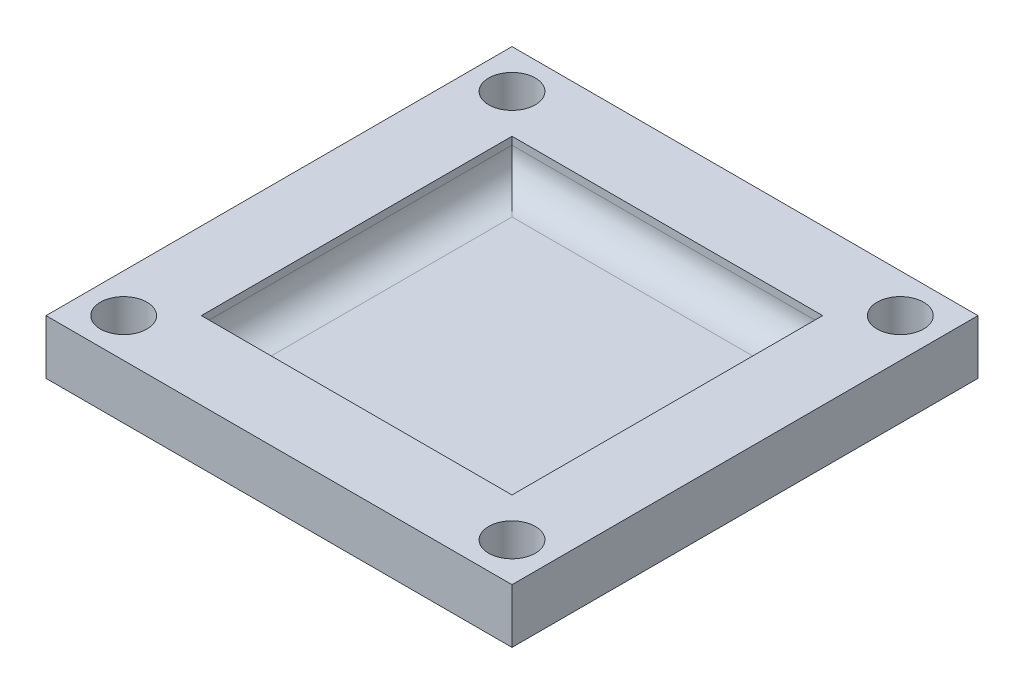
ISO-10303-21;
HEADER;
FILE_DESCRIPTION(('STEP AP214'),'2;1');
FILE_NAME('part.step','',(''),(''),'','','');
FILE_SCHEMA(('AUTOMOTIVE_DESIGN { 1 0 10303 214 1 1 1 1 }'));
ENDSEC;
DATA;
#1=APPLICATION_CONTEXT('core data for automotive mechanical design processes');
#2=APPLICATION_PROTOCOL_DEFINITION('international standard','automotive_design',2000,#1);
#3=PRODUCT_CONTEXT('',#1,'mechanical');
#4=PRODUCT('Part','Part','',(#3));
#5=PRODUCT_RELATED_PRODUCT_CATEGORY('part','',(#4));
#6=PRODUCT_DEFINITION_FORMATION('','',#4);
#7=PRODUCT_DEFINITION_CONTEXT('part definition',#1,'design');
#8=PRODUCT_DEFINITION('design','',#6,#7);
#9=PRODUCT_DEFINITION_SHAPE('','',#8);
#10=(LENGTH_UNIT() NAMED_UNIT(*) SI_UNIT(.MILLI.,.METRE.));
#11=(NAMED_UNIT(*) PLANE_ANGLE_UNIT() SI_UNIT($,.RADIAN.));
#12=(NAMED_UNIT(*) SI_UNIT($,.STERADIAN.) SOLID_ANGLE_UNIT());
#13=UNCERTAINTY_MEASURE_WITH_UNIT(LENGTH_MEASURE(1.E-05),#10,'distance_accuracy_value','');
#14=(GEOMETRIC_REPRESENTATION_CONTEXT(3) GLOBAL_UNCERTAINTY_ASSIGNED_CONTEXT((#13)) GLOBAL_UNIT_ASSIGNED_CONTEXT((#10,
#11,#12)) REPRESENTATION_CONTEXT('',''));
#15=CARTESIAN_POINT('',(0.,0.,0.));
#16=DIRECTION('',(0.,0.,1.));
#17=DIRECTION('',(1.,0.,0.));
#18=AXIS2_PLACEMENT_3D('',#15,#16,#17);
#19=CARTESIAN_POINT('',(-9.99999999999091,3.5,291583.5));
#20=DIRECTION('',(-1.,0.,0.));
#21=DIRECTION('',(0.,0.,1.));
#22=AXIS2_PLACEMENT_3D('',#19,#20,#21);
#23=PLANE('',#22);
#24=DIRECTION('',(0.,-1.,0.));
#25=VECTOR('',#24,1.);
#26=CARTESIAN_POINT('',(-9.99999999999091,3.5,9.99999999999091));
#27=LINE('',#26,#25);
#28=CARTESIAN_POINT('',(-9.99999999999091,3.5,9.99999999999091));
#29=VERTEX_POINT('',#28);
#30=CARTESIAN_POINT('',(-9.99999999999091,3.,9.99999999999091));
#31=VERTEX_POINT('',#30);
#32=EDGE_CURVE('E148',#29,#31,#27,.T.);
#33=ORIENTED_EDGE('',*,*,#32,.T.);
#34=DIRECTION('',(0.,0.,-1.));
#35=VECTOR('',#34,1.);
#36=CARTESIAN_POINT('',(-9.99999999999091,3.,-9.99999999999091));
#37=LINE('',#36,#35);
#38=CARTESIAN_POINT('',(-9.99999999999091,3.,-9.99999999999091));
#39=VERTEX_POINT('',#38);
#40=EDGE_CURVE('E11',#31,#39,#37,.T.);
#41=ORIENTED_EDGE('',*,*,#40,.T.);
#42=DIRECTION('',(0.,-1.,0.));
#43=VECTOR('',#42,1.);
#44=CARTESIAN_POINT('',(-9.99999999999091,3.5,-9.99999999999091));
#45=LINE('',#44,#43);
#46=CARTESIAN_POINT('',(-9.99999999999091,3.5,-9.99999999999091));
#47=VERTEX_POINT('',#46);
#48=EDGE_CURVE('E115',#47,#39,#45,.T.);
#49=ORIENTED_EDGE('',*,*,#48,.F.);
#50=DIRECTION('',(0.,0.,-1.));
#51=VECTOR('',#50,1.);
#52=CARTESIAN_POINT('',(-9.99999999999091,3.5,291583.5));
#53=LINE('',#52,#51);
#54=EDGE_CURVE('E118',#29,#47,#53,.T.);
#55=ORIENTED_EDGE('',*,*,#54,.F.);
#56=EDGE_LOOP('',(#33,#41,#49,#55));
#57=FACE_BOUND('',#56,.T.);
#58=ADVANCED_FACE('F39',(#57),#23,.F.);
#59=CARTESIAN_POINT('',(-400000.,3.5,9.99999999999091));
#60=DIRECTION('',(0.,0.,1.));
#61=DIRECTION('',(1.,0.,0.));
#62=AXIS2_PLACEMENT_3D('',#59,#60,#61);
#63=PLANE('',#62);
#64=DIRECTION('',(0.,-1.,0.));
#65=VECTOR('',#64,1.);
#66=CARTESIAN_POINT('',(9.99999999999091,3.5,9.99999999999091));
#67=LINE('',#66,#65);
#68=CARTESIAN_POINT('',(9.99999999999091,3.5,9.99999999999091));
#69=VERTEX_POINT('',#68);
#70=CARTESIAN_POINT('',(9.99999999999091,3.,9.99999999999091));
#71=VERTEX_POINT('',#70);
#72=EDGE_CURVE('E151',#69,#71,#67,.T.);
#73=ORIENTED_EDGE('',*,*,#72,.T.);
#74=DIRECTION('',(1.,0.,0.));
#75=VECTOR('',#74,1.);
#76=CARTESIAN_POINT('',(-9.99999999999091,3.,9.99999999999091));
#77=LINE('',#76,#75);
#78=EDGE_CURVE('E62',#71,#31,#77,.F.);
#79=ORIENTED_EDGE('',*,*,#78,.T.);
#80=ORIENTED_EDGE('',*,*,#32,.F.);
#81=DIRECTION('',(-1.,0.,0.));
#82=VECTOR('',#81,1.);
#83=CARTESIAN_POINT('',(-400000.,3.5,9.99999999999091));
#84=LINE('',#83,#82);
#85=EDGE_CURVE('E123',#69,#29,#84,.T.);
#86=ORIENTED_EDGE('',*,*,#85,.F.);
#87=EDGE_LOOP('',(#73,#79,#80,#86));
#88=FACE_BOUND('',#87,.T.);
#89=ADVANCED_FACE('F258',(#88),#63,.F.);
#90=CARTESIAN_POINT('',(9.99999999999091,3.5,291583.5));
#91=DIRECTION('',(1.,0.,0.));
#92=DIRECTION('',(0.,0.,-1.));
#93=AXIS2_PLACEMENT_3D('',#90,#91,#92);
#94=PLANE('',#93);
#95=DIRECTION('',(0.,-1.,0.));
#96=VECTOR('',#95,1.);
#97=CARTESIAN_POINT('',(9.99999999999091,3.5,-9.99999999999091));
#98=LINE('',#97,#96);
#99=CARTESIAN_POINT('',(9.99999999999091,3.5,-9.99999999999091));
#100=VERTEX_POINT('',#99);
#101=CARTESIAN_POINT('',(9.99999999999091,3.,-9.99999999999091));
#102=VERTEX_POINT('',#101);
#103=EDGE_CURVE('E122',#100,#102,#98,.T.);
#104=ORIENTED_EDGE('',*,*,#103,.T.);
#105=DIRECTION('',(0.,0.,-1.));
#106=VECTOR('',#105,1.);
#107=CARTESIAN_POINT('',(9.99999999999091,3.,9.99999999999091));
#108=LINE('',#107,#106);
#109=EDGE_CURVE('E194',#102,#71,#108,.F.);
#110=ORIENTED_EDGE('',*,*,#109,.T.);
#111=ORIENTED_EDGE('',*,*,#72,.F.);
#112=DIRECTION('',(0.,0.,1.));
#113=VECTOR('',#112,1.);
#114=CARTESIAN_POINT('',(9.99999999999091,3.5,291583.5));
#115=LINE('',#114,#113);
#116=EDGE_CURVE('E132',#100,#69,#115,.T.);
#117=ORIENTED_EDGE('',*,*,#116,.F.);
#118=EDGE_LOOP('',(#104,#110,#111,#117));
#119=FACE_BOUND('',#118,.T.);
#120=ADVANCED_FACE('F262',(#119),#94,.F.);
#121=CARTESIAN_POINT('',(-400000.,3.5,-9.99999999999091));
#122=DIRECTION('',(0.,0.,-1.));
#123=DIRECTION('',(-1.,0.,0.));
#124=AXIS2_PLACEMENT_3D('',#121,#122,#123);
#125=PLANE('',#124);
#126=ORIENTED_EDGE('',*,*,#48,.T.);
#127=DIRECTION('',(1.,0.,0.));
#128=VECTOR('',#127,1.);
#129=CARTESIAN_POINT('',(9.99999999999091,3.,-9.99999999999091));
#130=LINE('',#129,#128);
#131=EDGE_CURVE('E48',#39,#102,#130,.T.);
#132=ORIENTED_EDGE('',*,*,#131,.T.);
#133=ORIENTED_EDGE('',*,*,#103,.F.);
#134=DIRECTION('',(1.,0.,0.));
#135=VECTOR('',#134,1.);
#136=CARTESIAN_POINT('',(-400000.,3.5,-9.99999999999091));
#137=LINE('',#136,#135);
#138=EDGE_CURVE('E127',#47,#100,#137,.T.);
#139=ORIENTED_EDGE('',*,*,#138,.F.);
#140=EDGE_LOOP('',(#126,#132,#133,#139));
#141=FACE_BOUND('',#140,.T.);
#142=ADVANCED_FACE('F128',(#141),#125,.F.);
#143=CARTESIAN_POINT('',(-14.9999999999864,3.5,291583.5));
#144=DIRECTION('',(-1.,0.,0.));
#145=DIRECTION('',(0.,0.,1.));
#146=AXIS2_PLACEMENT_3D('',#143,#144,#145);
#147=PLANE('',#146);
#148=DIRECTION('',(0.,0.,-1.));
#149=VECTOR('',#148,1.);
#150=CARTESIAN_POINT('',(-14.9999999999864,0.,291583.5));
#151=LINE('',#150,#149);
#152=CARTESIAN_POINT('',(-14.9999999999864,0.,14.9999999999864));
#153=VERTEX_POINT('',#152);
#154=CARTESIAN_POINT('',(-14.9999999999864,0.,-14.9999999999864));
#155=VERTEX_POINT('',#154);
#156=EDGE_CURVE('E150',#153,#155,#151,.T.);
#157=ORIENTED_EDGE('',*,*,#156,.F.);
#158=DIRECTION('',(0.,-1.,0.));
#159=VECTOR('',#158,1.);
#160=CARTESIAN_POINT('',(-14.9999999999864,3.5,14.9999999999864));
#161=LINE('',#160,#159);
#162=CARTESIAN_POINT('',(-14.9999999999864,3.5,14.9999999999864));
#163=VERTEX_POINT('',#162);
#164=EDGE_CURVE('E178',#163,#153,#161,.T.);
#165=ORIENTED_EDGE('',*,*,#164,.F.);
#166=DIRECTION('',(0.,0.,-1.));
#167=VECTOR('',#166,1.);
#168=CARTESIAN_POINT('',(-14.9999999999864,3.5,291583.5));
#169=LINE('',#168,#167);
#170=CARTESIAN_POINT('',(-14.9999999999864,3.5,-14.9999999999864));
#171=VERTEX_POINT('',#170);
#172=EDGE_CURVE('E154',#163,#171,#169,.T.);
#173=ORIENTED_EDGE('',*,*,#172,.T.);
#174=DIRECTION('',(0.,-1.,0.));
#175=VECTOR('',#174,1.);
#176=CARTESIAN_POINT('',(-14.9999999999864,3.5,-14.9999999999864));
#177=LINE('',#176,#175);
#178=EDGE_CURVE('E167',#171,#155,#177,.T.);
#179=ORIENTED_EDGE('',*,*,#178,.T.);
#180=EDGE_LOOP('',(#157,#165,#173,#179));
#181=FACE_BOUND('',#180,.T.);
#182=ADVANCED_FACE('F234',(#181),#147,.T.);
#183=CARTESIAN_POINT('',(-400000.,3.5,14.9999999999864));
#184=DIRECTION('',(0.,0.,1.));
#185=DIRECTION('',(1.,0.,0.));
#186=AXIS2_PLACEMENT_3D('',#183,#184,#185);
#187=PLANE('',#186);
#188=DIRECTION('',(-1.,0.,0.));
#189=VECTOR('',#188,1.);
#190=CARTESIAN_POINT('',(-400000.,0.,14.9999999999864));
#191=LINE('',#190,#189);
#192=CARTESIAN_POINT('',(14.9999999999864,0.,14.9999999999864));
#193=VERTEX_POINT('',#192);
#194=EDGE_CURVE('E158',#193,#153,#191,.T.);
#195=ORIENTED_EDGE('',*,*,#194,.F.);
#196=DIRECTION('',(0.,-1.,0.));
#197=VECTOR('',#196,1.);
#198=CARTESIAN_POINT('',(14.9999999999864,3.5,14.9999999999864));
#199=LINE('',#198,#197);
#200=CARTESIAN_POINT('',(14.9999999999864,3.5,14.9999999999864));
#201=VERTEX_POINT('',#200);
#202=EDGE_CURVE('E181',#201,#193,#199,.T.);
#203=ORIENTED_EDGE('',*,*,#202,.F.);
#204=DIRECTION('',(-1.,0.,0.));
#205=VECTOR('',#204,1.);
#206=CARTESIAN_POINT('',(-400000.,3.5,14.9999999999864));
#207=LINE('',#206,#205);
#208=EDGE_CURVE('E164',#201,#163,#207,.T.);
#209=ORIENTED_EDGE('',*,*,#208,.T.);
#210=ORIENTED_EDGE('',*,*,#164,.T.);
#211=EDGE_LOOP('',(#195,#203,#209,#210));
#212=FACE_BOUND('',#211,.T.);
#213=ADVANCED_FACE('F244',(#212),#187,.T.);
#214=CARTESIAN_POINT('',(14.9999999999864,3.5,291583.5));
#215=DIRECTION('',(1.,0.,0.));
#216=DIRECTION('',(0.,0.,-1.));
#217=AXIS2_PLACEMENT_3D('',#214,#215,#216);
#218=PLANE('',#217);
#219=DIRECTION('',(0.,0.,1.));
#220=VECTOR('',#219,1.);
#221=CARTESIAN_POINT('',(14.9999999999864,0.,291583.5));
#222=LINE('',#221,#220);
#223=CARTESIAN_POINT('',(14.9999999999864,0.,-14.9999999999864));
#224=VERTEX_POINT('',#223);
#225=EDGE_CURVE('E173',#224,#193,#222,.T.);
#226=ORIENTED_EDGE('',*,*,#225,.F.);
#227=DIRECTION('',(0.,-1.,0.));
#228=VECTOR('',#227,1.);
#229=CARTESIAN_POINT('',(14.9999999999864,3.5,-14.9999999999864));
#230=LINE('',#229,#228);
#231=CARTESIAN_POINT('',(14.9999999999864,3.5,-14.9999999999864));
#232=VERTEX_POINT('',#231);
#233=EDGE_CURVE('E183',#232,#224,#230,.T.);
#234=ORIENTED_EDGE('',*,*,#233,.F.);
#235=DIRECTION('',(0.,0.,1.));
#236=VECTOR('',#235,1.);
#237=CARTESIAN_POINT('',(14.9999999999864,3.5,291583.5));
#238=LINE('',#237,#236);
#239=EDGE_CURVE('E161',#232,#201,#238,.T.);
#240=ORIENTED_EDGE('',*,*,#239,.T.);
#241=ORIENTED_EDGE('',*,*,#202,.T.);
#242=EDGE_LOOP('',(#226,#234,#240,#241));
#243=FACE_BOUND('',#242,.T.);
#244=ADVANCED_FACE('F242',(#243),#218,.T.);
#245=CARTESIAN_POINT('',(-400000.,3.5,-14.9999999999864));
#246=DIRECTION('',(0.,0.,-1.));
#247=DIRECTION('',(-1.,0.,0.));
#248=AXIS2_PLACEMENT_3D('',#245,#246,#247);
#249=PLANE('',#248);
#250=DIRECTION('',(1.,0.,0.));
#251=VECTOR('',#250,1.);
#252=CARTESIAN_POINT('',(-400000.,0.,-14.9999999999864));
#253=LINE('',#252,#251);
#254=EDGE_CURVE('E170',#155,#224,#253,.T.);
#255=ORIENTED_EDGE('',*,*,#254,.F.);
#256=ORIENTED_EDGE('',*,*,#178,.F.);
#257=DIRECTION('',(1.,0.,0.));
#258=VECTOR('',#257,1.);
#259=CARTESIAN_POINT('',(-400000.,3.5,-14.9999999999864));
#260=LINE('',#259,#258);
#261=EDGE_CURVE('E157',#171,#232,#260,.T.);
#262=ORIENTED_EDGE('',*,*,#261,.T.);
#263=ORIENTED_EDGE('',*,*,#233,.T.);
#264=EDGE_LOOP('',(#255,#256,#262,#263));
#265=FACE_BOUND('',#264,.T.);
#266=ADVANCED_FACE('F238',(#265),#249,.T.);
#267=CARTESIAN_POINT('',(0.,3.5,0.));
#268=DIRECTION('',(0.,-1.,0.));
#269=DIRECTION('',(0.,0.,-1.));
#270=AXIS2_PLACEMENT_3D('',#267,#268,#269);
#271=PLANE('',#270);
#272=CARTESIAN_POINT('',(-12.4999999999932,3.5,12.4999999999932));
#273=DIRECTION('',(0.,1.,0.));
#274=DIRECTION('',(0.,0.,1.));
#275=AXIS2_PLACEMENT_3D('',#272,#273,#274);
#276=CIRCLE('',#275,1.5);
#277=CARTESIAN_POINT('',(-12.4999999999932,3.5,13.9999999999932));
#278=VERTEX_POINT('',#277);
#279=EDGE_CURVE('E297',#278,#278,#276,.T.);
#280=ORIENTED_EDGE('',*,*,#279,.F.);
#281=EDGE_LOOP('',(#280));
#282=FACE_BOUND('',#281,.T.);
#283=CARTESIAN_POINT('',(12.4999999999955,3.5,12.4999999999955));
#284=DIRECTION('',(0.,1.,0.));
#285=DIRECTION('',(0.,0.,1.));
#286=AXIS2_PLACEMENT_3D('',#283,#284,#285);
#287=CIRCLE('',#286,1.5);
#288=CARTESIAN_POINT('',(12.4999999999955,3.5,13.9999999999955));
#289=VERTEX_POINT('',#288);
#290=EDGE_CURVE('E293',#289,#289,#287,.T.);
#291=ORIENTED_EDGE('',*,*,#290,.F.);
#292=EDGE_LOOP('',(#291));
#293=FACE_BOUND('',#292,.T.);
#294=CARTESIAN_POINT('',(12.4999999999932,3.5,-12.4999999999932));
#295=DIRECTION('',(0.,1.,0.));
#296=DIRECTION('',(0.,0.,1.));
#297=AXIS2_PLACEMENT_3D('',#294,#295,#296);
#298=CIRCLE('',#297,1.5);
#299=CARTESIAN_POINT('',(12.4999999999932,3.5,-10.9999999999932));
#300=VERTEX_POINT('',#299);
#301=EDGE_CURVE('E291',#300,#300,#298,.T.);
#302=ORIENTED_EDGE('',*,*,#301,.F.);
#303=EDGE_LOOP('',(#302));
#304=FACE_BOUND('',#303,.T.);
#305=CARTESIAN_POINT('',(-12.4999999999886,3.5,-12.4999999999886));
#306=DIRECTION('',(0.,1.,0.));
#307=DIRECTION('',(0.,0.,1.));
#308=AXIS2_PLACEMENT_3D('',#305,#306,#307);
#309=CIRCLE('',#308,1.5);
#310=CARTESIAN_POINT('',(-12.4999999999886,3.5,-10.9999999999886));
#311=VERTEX_POINT('',#310);
#312=EDGE_CURVE('E143',#311,#311,#309,.T.);
#313=ORIENTED_EDGE('',*,*,#312,.F.);
#314=EDGE_LOOP('',(#313));
#315=FACE_BOUND('',#314,.T.);
#316=ORIENTED_EDGE('',*,*,#85,.T.);
#317=ORIENTED_EDGE('',*,*,#54,.T.);
#318=ORIENTED_EDGE('',*,*,#138,.T.);
#319=ORIENTED_EDGE('',*,*,#116,.T.);
#320=EDGE_LOOP('',(#316,#317,#318,#319));
#321=FACE_BOUND('',#320,.T.);
#322=ORIENTED_EDGE('',*,*,#172,.F.);
#323=ORIENTED_EDGE('',*,*,#208,.F.);
#324=ORIENTED_EDGE('',*,*,#239,.F.);
#325=ORIENTED_EDGE('',*,*,#261,.F.);
#326=EDGE_LOOP('',(#322,#323,#324,#325));
#327=FACE_BOUND('',#326,.T.);
#328=ADVANCED_FACE('F134',(#282,#293,#304,#315,#321,#327),#271,.F.);
#329=CARTESIAN_POINT('',(0.,0.,0.));
#330=DIRECTION('',(0.,-1.,0.));
#331=DIRECTION('',(0.,0.,-1.));
#332=AXIS2_PLACEMENT_3D('',#329,#330,#331);
#333=PLANE('',#332);
#334=CARTESIAN_POINT('',(-12.4999999999932,0.,12.4999999999932));
#335=DIRECTION('',(0.,-1.,0.));
#336=DIRECTION('',(0.,0.,-1.));
#337=AXIS2_PLACEMENT_3D('',#334,#335,#336);
#338=CIRCLE('',#337,1.5);
#339=CARTESIAN_POINT('',(-12.4999999999932,0.,10.9999999999932));
#340=VERTEX_POINT('',#339);
#341=EDGE_CURVE('E43',#340,#340,#338,.T.);
#342=ORIENTED_EDGE('',*,*,#341,.F.);
#343=EDGE_LOOP('',(#342));
#344=FACE_BOUND('',#343,.T.);
#345=CARTESIAN_POINT('',(12.4999999999955,0.,12.4999999999955));
#346=DIRECTION('',(0.,-1.,0.));
#347=DIRECTION('',(0.,0.,-1.));
#348=AXIS2_PLACEMENT_3D('',#345,#346,#347);
#349=CIRCLE('',#348,1.5);
#350=CARTESIAN_POINT('',(12.4999999999955,0.,10.9999999999955));
#351=VERTEX_POINT('',#350);
#352=EDGE_CURVE('E210',#351,#351,#349,.T.);
#353=ORIENTED_EDGE('',*,*,#352,.F.);
#354=EDGE_LOOP('',(#353));
#355=FACE_BOUND('',#354,.T.);
#356=CARTESIAN_POINT('',(12.4999999999932,0.,-12.4999999999932));
#357=DIRECTION('',(0.,-1.,0.));
#358=DIRECTION('',(0.,0.,-1.));
#359=AXIS2_PLACEMENT_3D('',#356,#357,#358);
#360=CIRCLE('',#359,1.5);
#361=CARTESIAN_POINT('',(12.4999999999932,0.,-13.9999999999932));
#362=VERTEX_POINT('',#361);
#363=EDGE_CURVE('E208',#362,#362,#360,.T.);
#364=ORIENTED_EDGE('',*,*,#363,.F.);
#365=EDGE_LOOP('',(#364));
#366=FACE_BOUND('',#365,.T.);
#367=CARTESIAN_POINT('',(-12.4999999999886,0.,-12.4999999999886));
#368=DIRECTION('',(0.,-1.,0.));
#369=DIRECTION('',(0.,0.,-1.));
#370=AXIS2_PLACEMENT_3D('',#367,#368,#369);
#371=CIRCLE('',#370,1.5);
#372=CARTESIAN_POINT('',(-12.4999999999886,0.,-13.9999999999886));
#373=VERTEX_POINT('',#372);
#374=EDGE_CURVE('E205',#373,#373,#371,.T.);
#375=ORIENTED_EDGE('',*,*,#374,.F.);
#376=EDGE_LOOP('',(#375));
#377=FACE_BOUND('',#376,.T.);
#378=ORIENTED_EDGE('',*,*,#156,.T.);
#379=ORIENTED_EDGE('',*,*,#254,.T.);
#380=ORIENTED_EDGE('',*,*,#225,.T.);
#381=ORIENTED_EDGE('',*,*,#194,.T.);
#382=EDGE_LOOP('',(#378,#379,#380,#381));
#383=FACE_BOUND('',#382,.T.);
#384=ADVANCED_FACE('F220',(#344,#355,#366,#377,#383),#333,.T.);
#385=CARTESIAN_POINT('',(0.,1.,0.));
#386=DIRECTION('',(0.,-1.,0.));
#387=DIRECTION('',(0.,0.,-1.));
#388=AXIS2_PLACEMENT_3D('',#385,#386,#387);
#389=PLANE('',#388);
#390=DIRECTION('',(1.,0.,0.));
#391=VECTOR('',#390,1.);
#392=CARTESIAN_POINT('',(9.99999999999091,1.,7.99999999999091));
#393=LINE('',#392,#391);
#394=CARTESIAN_POINT('',(-7.99999999999091,1.,7.99999999999091));
#395=VERTEX_POINT('',#394);
#396=CARTESIAN_POINT('',(7.99999999999091,1.,7.99999999999091));
#397=VERTEX_POINT('',#396);
#398=EDGE_CURVE('E189',#395,#397,#393,.T.);
#399=ORIENTED_EDGE('',*,*,#398,.T.);
#400=DIRECTION('',(0.,0.,-1.));
#401=VECTOR('',#400,1.);
#402=CARTESIAN_POINT('',(7.99999999999091,1.,-9.99999999999091));
#403=LINE('',#402,#401);
#404=CARTESIAN_POINT('',(7.99999999999091,1.,-7.99999999999091));
#405=VERTEX_POINT('',#404);
#406=EDGE_CURVE('E191',#397,#405,#403,.T.);
#407=ORIENTED_EDGE('',*,*,#406,.T.);
#408=DIRECTION('',(1.,0.,0.));
#409=VECTOR('',#408,1.);
#410=CARTESIAN_POINT('',(-9.99999999999091,1.,-7.99999999999091));
#411=LINE('',#410,#409);
#412=CARTESIAN_POINT('',(-7.99999999999091,1.,-7.99999999999091));
#413=VERTEX_POINT('',#412);
#414=EDGE_CURVE('E187',#405,#413,#411,.F.);
#415=ORIENTED_EDGE('',*,*,#414,.T.);
#416=DIRECTION('',(0.,0.,-1.));
#417=VECTOR('',#416,1.);
#418=CARTESIAN_POINT('',(-7.99999999999091,1.,9.99999999999091));
#419=LINE('',#418,#417);
#420=EDGE_CURVE('E180',#413,#395,#419,.F.);
#421=ORIENTED_EDGE('',*,*,#420,.T.);
#422=EDGE_LOOP('',(#399,#407,#415,#421));
#423=FACE_BOUND('',#422,.T.);
#424=ADVANCED_FACE('F223',(#423),#389,.F.);
#425=CARTESIAN_POINT('',(-7.99999999999091,3.,291583.5));
#426=DIRECTION('',(0.,0.,1.));
#427=DIRECTION('',(1.,0.,0.));
#428=AXIS2_PLACEMENT_3D('',#425,#426,#427);
#429=CYLINDRICAL_SURFACE('',#428,2.);
#430=CARTESIAN_POINT('',(-7.99999999998613,3.,-7.99999999998613));
#431=DIRECTION('',(-0.707106781186547,0.,0.707106781186547));
#432=DIRECTION('',(-0.707106781186547,0.,-0.707106781186547));
#433=AXIS2_PLACEMENT_3D('',#430,#431,#432);
#434=ELLIPSE('',#433,2.82842712474619,2.);
#435=EDGE_CURVE('E140',#39,#413,#434,.T.);
#436=ORIENTED_EDGE('',*,*,#435,.F.);
#437=ORIENTED_EDGE('',*,*,#40,.F.);
#438=CARTESIAN_POINT('',(-7.99999999999091,3.,7.99999999998613));
#439=DIRECTION('',(-0.707106781186547,0.,-0.707106781186547));
#440=DIRECTION('',(-0.707106781186547,0.,0.707106781186547));
#441=AXIS2_PLACEMENT_3D('',#438,#439,#440);
#442=ELLIPSE('',#441,2.82842712474619,2.);
#443=EDGE_CURVE('E137',#395,#31,#442,.T.);
#444=ORIENTED_EDGE('',*,*,#443,.F.);
#445=ORIENTED_EDGE('',*,*,#420,.F.);
#446=EDGE_LOOP('',(#436,#437,#444,#445));
#447=FACE_BOUND('',#446,.T.);
#448=ADVANCED_FACE('F41',(#447),#429,.F.);
#449=CARTESIAN_POINT('',(0.,3.,7.99999999999091));
#450=DIRECTION('',(-1.,0.,0.));
#451=DIRECTION('',(0.,0.,1.));
#452=AXIS2_PLACEMENT_3D('',#449,#450,#451);
#453=CYLINDRICAL_SURFACE('',#452,2.);
#454=ORIENTED_EDGE('',*,*,#443,.T.);
#455=ORIENTED_EDGE('',*,*,#78,.F.);
#456=CARTESIAN_POINT('',(7.99999999999091,3.,7.99999999999091));
#457=DIRECTION('',(-0.707106781186547,0.,0.707106781186547));
#458=DIRECTION('',(0.707106781186547,0.,0.707106781186547));
#459=AXIS2_PLACEMENT_3D('',#456,#457,#458);
#460=ELLIPSE('',#459,2.82842712474619,2.);
#461=EDGE_CURVE('E201',#397,#71,#460,.T.);
#462=ORIENTED_EDGE('',*,*,#461,.F.);
#463=ORIENTED_EDGE('',*,*,#398,.F.);
#464=EDGE_LOOP('',(#454,#455,#462,#463));
#465=FACE_BOUND('',#464,.T.);
#466=ADVANCED_FACE('F340',(#465),#453,.F.);
#467=CARTESIAN_POINT('',(-400000.,3.,-7.99999999999091));
#468=DIRECTION('',(-1.,0.,0.));
#469=DIRECTION('',(0.,0.,1.));
#470=AXIS2_PLACEMENT_3D('',#467,#468,#469);
#471=CYLINDRICAL_SURFACE('',#470,2.);
#472=ORIENTED_EDGE('',*,*,#435,.T.);
#473=ORIENTED_EDGE('',*,*,#414,.F.);
#474=CARTESIAN_POINT('',(7.99999999998613,3.,-7.99999999999091));
#475=DIRECTION('',(0.707106781186547,0.,0.707106781186547));
#476=DIRECTION('',(-0.707106781186547,0.,0.707106781186547));
#477=AXIS2_PLACEMENT_3D('',#474,#475,#476);
#478=ELLIPSE('',#477,2.82842712474619,2.);
#479=EDGE_CURVE('E199',#102,#405,#478,.F.);
#480=ORIENTED_EDGE('',*,*,#479,.F.);
#481=ORIENTED_EDGE('',*,*,#131,.F.);
#482=EDGE_LOOP('',(#472,#473,#480,#481));
#483=FACE_BOUND('',#482,.T.);
#484=ADVANCED_FACE('F331',(#483),#471,.F.);
#485=CARTESIAN_POINT('',(7.99999999999091,3.,0.));
#486=DIRECTION('',(0.,0.,1.));
#487=DIRECTION('',(1.,0.,0.));
#488=AXIS2_PLACEMENT_3D('',#485,#486,#487);
#489=CYLINDRICAL_SURFACE('',#488,2.);
#490=ORIENTED_EDGE('',*,*,#461,.T.);
#491=ORIENTED_EDGE('',*,*,#109,.F.);
#492=ORIENTED_EDGE('',*,*,#479,.T.);
#493=ORIENTED_EDGE('',*,*,#406,.F.);
#494=EDGE_LOOP('',(#490,#491,#492,#493));
#495=FACE_BOUND('',#494,.T.);
#496=ADVANCED_FACE('F277',(#495),#489,.F.);
#497=CARTESIAN_POINT('',(-12.4999999999886,-0.5,-12.4999999999886));
#498=DIRECTION('',(0.,1.,0.));
#499=DIRECTION('',(0.,0.,1.));
#500=AXIS2_PLACEMENT_3D('',#497,#498,#499);
#501=CYLINDRICAL_SURFACE('',#500,1.5);
#502=ORIENTED_EDGE('',*,*,#374,.T.);
#503=EDGE_LOOP('',(#502));
#504=FACE_BOUND('',#503,.T.);
#505=ORIENTED_EDGE('',*,*,#312,.T.);
#506=EDGE_LOOP('',(#505));
#507=FACE_BOUND('',#506,.T.);
#508=ADVANCED_FACE('F273',(#504,#507),#501,.F.);
#509=CARTESIAN_POINT('',(12.4999999999932,-0.5,-12.4999999999932));
#510=DIRECTION('',(0.,1.,0.));
#511=DIRECTION('',(0.,0.,1.));
#512=AXIS2_PLACEMENT_3D('',#509,#510,#511);
#513=CYLINDRICAL_SURFACE('',#512,1.5);
#514=ORIENTED_EDGE('',*,*,#363,.T.);
#515=EDGE_LOOP('',(#514));
#516=FACE_BOUND('',#515,.T.);
#517=ORIENTED_EDGE('',*,*,#301,.T.);
#518=EDGE_LOOP('',(#517));
#519=FACE_BOUND('',#518,.T.);
#520=ADVANCED_FACE('F276',(#516,#519),#513,.F.);
#521=CARTESIAN_POINT('',(12.4999999999955,-0.5,12.4999999999955));
#522=DIRECTION('',(0.,1.,0.));
#523=DIRECTION('',(0.,0.,1.));
#524=AXIS2_PLACEMENT_3D('',#521,#522,#523);
#525=CYLINDRICAL_SURFACE('',#524,1.5);
#526=ORIENTED_EDGE('',*,*,#352,.T.);
#527=EDGE_LOOP('',(#526));
#528=FACE_BOUND('',#527,.T.);
#529=ORIENTED_EDGE('',*,*,#290,.T.);
#530=EDGE_LOOP('',(#529));
#531=FACE_BOUND('',#530,.T.);
#532=ADVANCED_FACE('F281',(#528,#531),#525,.F.);
#533=CARTESIAN_POINT('',(-12.4999999999932,-0.5,12.4999999999932));
#534=DIRECTION('',(0.,1.,0.));
#535=DIRECTION('',(0.,0.,1.));
#536=AXIS2_PLACEMENT_3D('',#533,#534,#535);
#537=CYLINDRICAL_SURFACE('',#536,1.5);
#538=ORIENTED_EDGE('',*,*,#341,.T.);
#539=EDGE_LOOP('',(#538));
#540=FACE_BOUND('',#539,.T.);
#541=ORIENTED_EDGE('',*,*,#279,.T.);
#542=EDGE_LOOP('',(#541));
#543=FACE_BOUND('',#542,.T.);
#544=ADVANCED_FACE('F217',(#540,#543),#537,.F.);
#545=CLOSED_SHELL('',(#58,#89,#120,#142,#182,#213,#244,#266,#328,#384,#424,#448,#466,#484,#496,
#508,#520,#532,#544));
#546=MANIFOLD_SOLID_BREP('B2',#545);
#547=ADVANCED_BREP_SHAPE_REPRESENTATION('',(#18,#546),#14);
#548=SHAPE_DEFINITION_REPRESENTATION(#9,#547);
ENDSEC;
END-ISO-10303-21;
